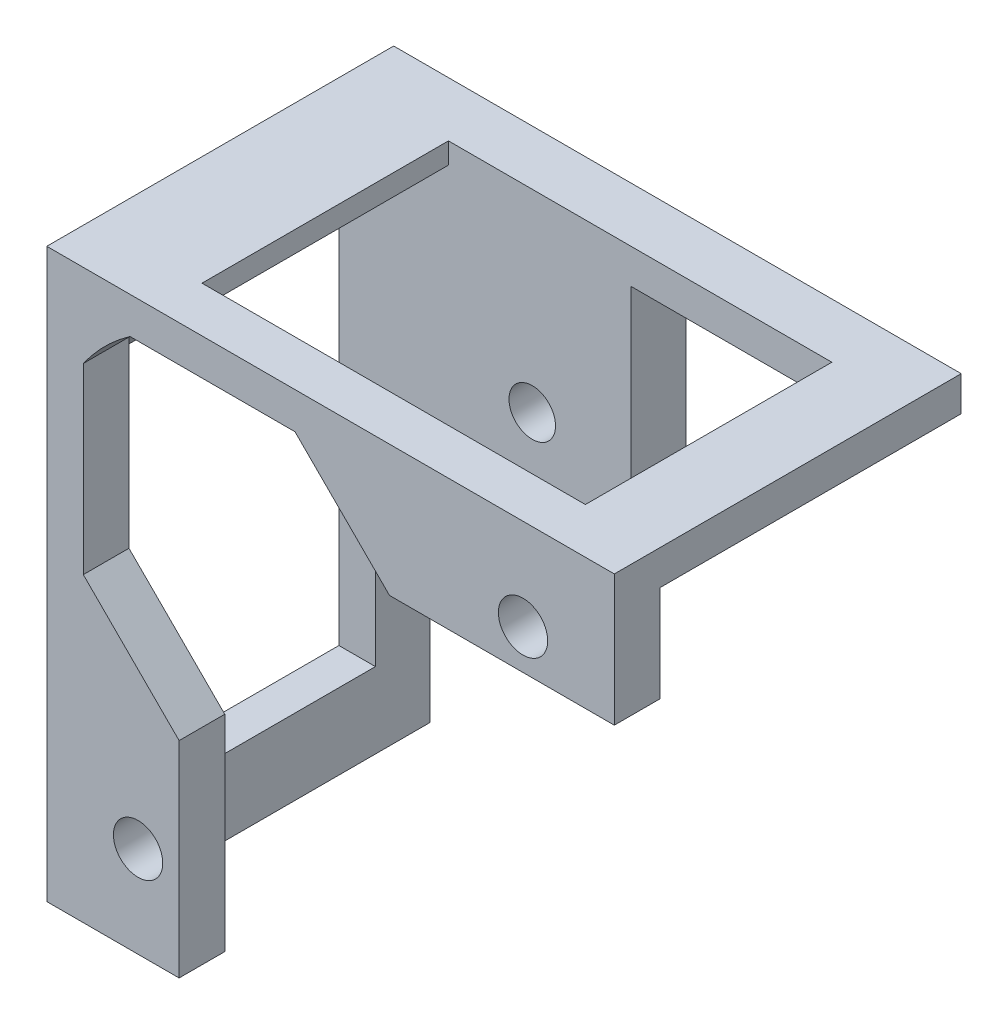
ISO-10303-21;
HEADER;
FILE_DESCRIPTION(('STEP AP214'),'2;1');
FILE_NAME('part.step','',(''),(''),'','','');
FILE_SCHEMA(('AUTOMOTIVE_DESIGN { 1 0 10303 214 1 1 1 1 }'));
ENDSEC;
DATA;
#1=APPLICATION_CONTEXT('core data for automotive mechanical design processes');
#2=APPLICATION_PROTOCOL_DEFINITION('international standard','automotive_design',2000,#1);
#3=PRODUCT_CONTEXT('',#1,'mechanical');
#4=PRODUCT('Part','Part','',(#3));
#5=PRODUCT_RELATED_PRODUCT_CATEGORY('part','',(#4));
#6=PRODUCT_DEFINITION_FORMATION('','',#4);
#7=PRODUCT_DEFINITION_CONTEXT('part definition',#1,'design');
#8=PRODUCT_DEFINITION('design','',#6,#7);
#9=PRODUCT_DEFINITION_SHAPE('','',#8);
#10=(LENGTH_UNIT() NAMED_UNIT(*) SI_UNIT(.MILLI.,.METRE.));
#11=(NAMED_UNIT(*) PLANE_ANGLE_UNIT() SI_UNIT($,.RADIAN.));
#12=(NAMED_UNIT(*) SI_UNIT($,.STERADIAN.) SOLID_ANGLE_UNIT());
#13=UNCERTAINTY_MEASURE_WITH_UNIT(LENGTH_MEASURE(1.E-05),#10,'distance_accuracy_value','');
#14=(GEOMETRIC_REPRESENTATION_CONTEXT(3) GLOBAL_UNCERTAINTY_ASSIGNED_CONTEXT((#13)) GLOBAL_UNIT_ASSIGNED_CONTEXT((#10,
#11,#12)) REPRESENTATION_CONTEXT('',''));
#15=CARTESIAN_POINT('',(0.,0.,0.));
#16=DIRECTION('',(0.,0.,1.));
#17=DIRECTION('',(1.,0.,0.));
#18=AXIS2_PLACEMENT_3D('',#15,#16,#17);
#19=CARTESIAN_POINT('',(-170.,122.805556255077,-421.));
#20=DIRECTION('',(0.,0.,1.));
#21=DIRECTION('',(1.,0.,0.));
#22=AXIS2_PLACEMENT_3D('',#19,#20,#21);
#23=CYLINDRICAL_SURFACE('',#22,2.7);
#24=CARTESIAN_POINT('',(-170.,122.805556255077,-421.));
#25=DIRECTION('',(0.,0.,1.));
#26=DIRECTION('',(1.,0.,0.));
#27=AXIS2_PLACEMENT_3D('',#24,#25,#26);
#28=CIRCLE('',#27,2.7);
#29=CARTESIAN_POINT('',(-172.7,122.805556255077,-421.));
#30=VERTEX_POINT('',#29);
#31=EDGE_CURVE('E471',#30,#30,#28,.T.);
#32=ORIENTED_EDGE('',*,*,#31,.F.);
#33=DIRECTION('',(0.,0.,1.));
#34=VECTOR('',#33,1.);
#35=CARTESIAN_POINT('',(-172.7,122.805556255077,-421.));
#36=LINE('',#35,#34);
#37=CARTESIAN_POINT('',(-172.7,122.805556255077,-416.));
#38=VERTEX_POINT('',#37);
#39=EDGE_CURVE('E11',#30,#38,#36,.T.);
#40=ORIENTED_EDGE('',*,*,#39,.T.);
#41=CARTESIAN_POINT('',(-170.,122.805556255077,-416.));
#42=DIRECTION('',(0.,0.,-1.));
#43=DIRECTION('',(1.,0.,0.));
#44=AXIS2_PLACEMENT_3D('',#41,#42,#43);
#45=CIRCLE('',#44,2.7);
#46=EDGE_CURVE('E350',#38,#38,#45,.T.);
#47=ORIENTED_EDGE('',*,*,#46,.F.);
#48=ORIENTED_EDGE('',*,*,#39,.F.);
#49=EDGE_LOOP('',(#32,#40,#47,#48));
#50=FACE_BOUND('',#49,.T.);
#51=ADVANCED_FACE('F16',(#50),#23,.F.);
#52=CARTESIAN_POINT('',(-127.830959656274,164.974596598802,-421.));
#53=DIRECTION('',(0.,0.,1.));
#54=DIRECTION('',(1.,0.,0.));
#55=AXIS2_PLACEMENT_3D('',#52,#53,#54);
#56=CYLINDRICAL_SURFACE('',#55,2.7);
#57=CARTESIAN_POINT('',(-127.830959656274,164.974596598802,-421.));
#58=DIRECTION('',(0.,0.,1.));
#59=DIRECTION('',(1.,0.,0.));
#60=AXIS2_PLACEMENT_3D('',#57,#58,#59);
#61=CIRCLE('',#60,2.7);
#62=CARTESIAN_POINT('',(-130.530959656274,164.974596598802,-421.));
#63=VERTEX_POINT('',#62);
#64=EDGE_CURVE('E444',#63,#63,#61,.T.);
#65=ORIENTED_EDGE('',*,*,#64,.F.);
#66=DIRECTION('',(0.,0.,1.));
#67=VECTOR('',#66,1.);
#68=CARTESIAN_POINT('',(-130.530959656274,164.974596598802,-421.));
#69=LINE('',#68,#67);
#70=CARTESIAN_POINT('',(-130.530959656274,164.974596598802,-416.));
#71=VERTEX_POINT('',#70);
#72=EDGE_CURVE('E27',#63,#71,#69,.T.);
#73=ORIENTED_EDGE('',*,*,#72,.T.);
#74=CARTESIAN_POINT('',(-127.830959656274,164.974596598802,-416.));
#75=DIRECTION('',(0.,0.,-1.));
#76=DIRECTION('',(1.,0.,0.));
#77=AXIS2_PLACEMENT_3D('',#74,#75,#76);
#78=CIRCLE('',#77,2.7);
#79=EDGE_CURVE('E355',#71,#71,#78,.T.);
#80=ORIENTED_EDGE('',*,*,#79,.F.);
#81=ORIENTED_EDGE('',*,*,#72,.F.);
#82=EDGE_LOOP('',(#65,#73,#80,#81));
#83=FACE_BOUND('',#82,.T.);
#84=ADVANCED_FACE('F689',(#83),#56,.F.);
#85=CARTESIAN_POINT('',(-144.000000730157,148.037299163668,-421.));
#86=DIRECTION('',(0.,0.,-1.));
#87=DIRECTION('',(0.,-1.,0.));
#88=AXIS2_PLACEMENT_3D('',#85,#86,#87);
#89=PLANE('',#88);
#90=ORIENTED_EDGE('',*,*,#31,.T.);
#91=EDGE_LOOP('',(#90));
#92=FACE_BOUND('',#91,.T.);
#93=DIRECTION('',(0.,1.,0.));
#94=VECTOR('',#93,1.);
#95=CARTESIAN_POINT('',(-165.504335240787,140.685936356161,-421.));
#96=LINE('',#95,#94);
#97=CARTESIAN_POINT('',(-165.504335240787,112.805556255077,-421.));
#98=VERTEX_POINT('',#97);
#99=CARTESIAN_POINT('',(-165.504335240787,135.328908789441,-421.));
#100=VERTEX_POINT('',#99);
#101=EDGE_CURVE('E374',#98,#100,#96,.T.);
#102=ORIENTED_EDGE('',*,*,#101,.F.);
#103=DIRECTION('',(-1.,0.,0.));
#104=VECTOR('',#103,1.);
#105=CARTESIAN_POINT('',(-160.,112.805556255077,-421.));
#106=LINE('',#105,#104);
#107=CARTESIAN_POINT('',(-176.,112.805556255077,-421.));
#108=VERTEX_POINT('',#107);
#109=EDGE_CURVE('E469',#98,#108,#106,.T.);
#110=ORIENTED_EDGE('',*,*,#109,.T.);
#111=DIRECTION('',(0.,-1.,0.));
#112=VECTOR('',#111,1.);
#113=CARTESIAN_POINT('',(-176.,130.421427709373,-421.));
#114=LINE('',#113,#112);
#115=CARTESIAN_POINT('',(-176.,121.100001728535,-421.000004917383));
#116=VERTEX_POINT('',#115);
#117=EDGE_CURVE('E296',#116,#108,#114,.T.);
#118=ORIENTED_EDGE('',*,*,#117,.F.);
#119=DIRECTION('',(-1.,0.,0.));
#120=VECTOR('',#119,1.);
#121=CARTESIAN_POINT('',(-180.,121.100001728535,-421.000004917383));
#122=LINE('',#121,#120);
#123=CARTESIAN_POINT('',(-180.,121.100001728535,-421.000004917383));
#124=VERTEX_POINT('',#123);
#125=EDGE_CURVE('E293',#116,#124,#122,.T.);
#126=ORIENTED_EDGE('',*,*,#125,.T.);
#127=DIRECTION('',(0.,1.,0.));
#128=VECTOR('',#127,1.);
#129=CARTESIAN_POINT('',(-180.,121.100001728535,-421.000004917383));
#130=LINE('',#129,#128);
#131=CARTESIAN_POINT('',(-180.,164.100002369285,-421.000004917383));
#132=VERTEX_POINT('',#131);
#133=EDGE_CURVE('E315',#124,#132,#130,.T.);
#134=ORIENTED_EDGE('',*,*,#133,.T.);
#135=DIRECTION('',(1.,0.,0.));
#136=VECTOR('',#135,1.);
#137=CARTESIAN_POINT('',(-180.,164.100002369285,-421.000004917383));
#138=LINE('',#137,#136);
#139=CARTESIAN_POINT('',(-177.109013287322,164.100002369285,-421.000004917383));
#140=VERTEX_POINT('',#139);
#141=EDGE_CURVE('E402',#132,#140,#138,.T.);
#142=ORIENTED_EDGE('',*,*,#141,.T.);
#143=CARTESIAN_POINT('',(-158.82150839458,153.796104993382,-421.));
#144=DIRECTION('',(0.,0.,-1.));
#145=DIRECTION('',(1.,0.,0.));
#146=AXIS2_PLACEMENT_3D('',#143,#144,#145);
#147=CIRCLE('',#146,20.9905487383057);
#148=CARTESIAN_POINT('',(-176.,165.858549293677,-421.));
#149=VERTEX_POINT('',#148);
#150=EDGE_CURVE('E349',#140,#149,#147,.T.);
#151=ORIENTED_EDGE('',*,*,#150,.T.);
#152=DIRECTION('',(0.,1.,0.));
#153=VECTOR('',#152,1.);
#154=CARTESIAN_POINT('',(-176.,112.805556255077,-421.));
#155=LINE('',#154,#153);
#156=CARTESIAN_POINT('',(-176.,145.824573548653,-421.));
#157=VERTEX_POINT('',#156);
#158=EDGE_CURVE('E472',#157,#149,#155,.T.);
#159=ORIENTED_EDGE('',*,*,#158,.F.);
#160=DIRECTION('',(0.707106781186548,-0.707106781186547,0.));
#161=VECTOR('',#160,1.);
#162=CARTESIAN_POINT('',(-165.430681586293,135.255255134946,-421.));
#163=LINE('',#162,#161);
#164=EDGE_CURVE('E375',#157,#100,#163,.T.);
#165=ORIENTED_EDGE('',*,*,#164,.T.);
#166=EDGE_LOOP('',(#102,#110,#118,#126,#134,#142,#151,#159,#165));
#167=FACE_BOUND('',#166,.T.);
#168=ADVANCED_FACE('F555',(#92,#167),#89,.T.);
#169=CARTESIAN_POINT('',(-180.,112.805556255077,-421.));
#170=DIRECTION('',(0.,-1.,0.));
#171=DIRECTION('',(0.,0.,-1.));
#172=AXIS2_PLACEMENT_3D('',#169,#170,#171);
#173=PLANE('',#172);
#174=ORIENTED_EDGE('',*,*,#109,.F.);
#175=DIRECTION('',(0.,0.,1.));
#176=VECTOR('',#175,1.);
#177=CARTESIAN_POINT('',(-165.504335240787,112.805556255077,-418.5));
#178=LINE('',#177,#176);
#179=CARTESIAN_POINT('',(-165.504335240787,112.805556255077,-416.));
#180=VERTEX_POINT('',#179);
#181=EDGE_CURVE('E451',#98,#180,#178,.T.);
#182=ORIENTED_EDGE('',*,*,#181,.T.);
#183=DIRECTION('',(1.,0.,0.));
#184=VECTOR('',#183,1.);
#185=CARTESIAN_POINT('',(-166.004335240787,112.805556255077,-416.));
#186=LINE('',#185,#184);
#187=CARTESIAN_POINT('',(-180.,112.805556255077,-416.));
#188=VERTEX_POINT('',#187);
#189=EDGE_CURVE('E339',#188,#180,#186,.T.);
#190=ORIENTED_EDGE('',*,*,#189,.F.);
#191=DIRECTION('',(0.,0.,1.));
#192=VECTOR('',#191,1.);
#193=CARTESIAN_POINT('',(-180.,112.805556255077,-418.5));
#194=LINE('',#193,#192);
#195=CARTESIAN_POINT('',(-180.,112.805556255077,-454.));
#196=VERTEX_POINT('',#195);
#197=EDGE_CURVE('E290',#196,#188,#194,.T.);
#198=ORIENTED_EDGE('',*,*,#197,.F.);
#199=DIRECTION('',(1.,0.,0.));
#200=VECTOR('',#199,1.);
#201=CARTESIAN_POINT('',(-180.,112.805556255077,-454.));
#202=LINE('',#201,#200);
#203=CARTESIAN_POINT('',(-176.,112.805556255077,-454.));
#204=VERTEX_POINT('',#203);
#205=EDGE_CURVE('E434',#196,#204,#202,.T.);
#206=ORIENTED_EDGE('',*,*,#205,.T.);
#207=DIRECTION('',(0.,0.,-1.));
#208=VECTOR('',#207,1.);
#209=CARTESIAN_POINT('',(-176.,112.805556255077,-421.));
#210=LINE('',#209,#208);
#211=EDGE_CURVE('E304',#108,#204,#210,.T.);
#212=ORIENTED_EDGE('',*,*,#211,.F.);
#213=EDGE_LOOP('',(#174,#182,#190,#198,#206,#212));
#214=FACE_BOUND('',#213,.T.);
#215=ADVANCED_FACE('F678',(#214),#173,.T.);
#216=CARTESIAN_POINT('',(-137.960368081204,170.974596598802,-416.));
#217=DIRECTION('',(0.,-1.,0.));
#218=DIRECTION('',(0.,0.,-1.));
#219=AXIS2_PLACEMENT_3D('',#216,#217,#218);
#220=PLANE('',#219);
#221=DIRECTION('',(0.,0.,1.));
#222=VECTOR('',#221,1.);
#223=CARTESIAN_POINT('',(-152.810368081204,170.974596598802,-416.));
#224=LINE('',#223,#222);
#225=CARTESIAN_POINT('',(-152.810368081204,170.974596598802,-421.));
#226=VERTEX_POINT('',#225);
#227=CARTESIAN_POINT('',(-152.810368081204,170.974596598802,-416.));
#228=VERTEX_POINT('',#227);
#229=EDGE_CURVE('E481',#226,#228,#224,.T.);
#230=ORIENTED_EDGE('',*,*,#229,.T.);
#231=DIRECTION('',(-1.,0.,0.));
#232=VECTOR('',#231,1.);
#233=CARTESIAN_POINT('',(-117.830959656274,170.974596598802,-416.));
#234=LINE('',#233,#232);
#235=CARTESIAN_POINT('',(-170.883952694875,170.974596598802,-416.));
#236=VERTEX_POINT('',#235);
#237=EDGE_CURVE('E504',#228,#236,#234,.T.);
#238=ORIENTED_EDGE('',*,*,#237,.T.);
#239=DIRECTION('',(0.,0.,-1.));
#240=VECTOR('',#239,1.);
#241=CARTESIAN_POINT('',(-170.883952694875,170.974596598802,-454.));
#242=LINE('',#241,#240);
#243=CARTESIAN_POINT('',(-170.883952694875,170.974596598802,-421.));
#244=VERTEX_POINT('',#243);
#245=EDGE_CURVE('E376',#236,#244,#242,.T.);
#246=ORIENTED_EDGE('',*,*,#245,.T.);
#247=DIRECTION('',(1.,0.,0.));
#248=VECTOR('',#247,1.);
#249=CARTESIAN_POINT('',(-140.98018440568,170.974596598802,-421.));
#250=LINE('',#249,#248);
#251=EDGE_CURVE('E410',#244,#226,#250,.T.);
#252=ORIENTED_EDGE('',*,*,#251,.T.);
#253=EDGE_LOOP('',(#230,#238,#246,#252));
#254=FACE_BOUND('',#253,.T.);
#255=ADVANCED_FACE('F680',(#254),#220,.T.);
#256=CARTESIAN_POINT('',(-126.000001728535,174.974596598802,-425.000004902482));
#257=DIRECTION('',(-1.,0.,0.));
#258=DIRECTION('',(0.,0.,1.));
#259=AXIS2_PLACEMENT_3D('',#256,#257,#258);
#260=PLANE('',#259);
#261=DIRECTION('',(0.,1.,0.));
#262=VECTOR('',#261,1.);
#263=CARTESIAN_POINT('',(-126.000001728535,164.385350796092,-448.));
#264=LINE('',#263,#262);
#265=CARTESIAN_POINT('',(-126.000001728535,171.171527858595,-448.000005155802));
#266=VERTEX_POINT('',#265);
#267=CARTESIAN_POINT('',(-126.000001728535,174.974596598802,-448.000005155802));
#268=VERTEX_POINT('',#267);
#269=EDGE_CURVE('E321',#266,#268,#264,.T.);
#270=ORIENTED_EDGE('',*,*,#269,.F.);
#271=DIRECTION('',(0.,0.,1.));
#272=VECTOR('',#271,1.);
#273=CARTESIAN_POINT('',(-126.000001728535,171.171527858595,-431.500002577901));
#274=LINE('',#273,#272);
#275=CARTESIAN_POINT('',(-126.000001728535,171.171527858595,-421.000004902482));
#276=VERTEX_POINT('',#275);
#277=EDGE_CURVE('E20',#266,#276,#274,.T.);
#278=ORIENTED_EDGE('',*,*,#277,.T.);
#279=DIRECTION('',(0.,-1.,0.));
#280=VECTOR('',#279,1.);
#281=CARTESIAN_POINT('',(-126.000001728535,174.974596598802,-421.000004902482));
#282=LINE('',#281,#280);
#283=CARTESIAN_POINT('',(-126.000001728535,174.974596598802,-421.000004902482));
#284=VERTEX_POINT('',#283);
#285=EDGE_CURVE('E399',#284,#276,#282,.T.);
#286=ORIENTED_EDGE('',*,*,#285,.F.);
#287=DIRECTION('',(0.,0.,-1.));
#288=VECTOR('',#287,1.);
#289=CARTESIAN_POINT('',(-126.000001728535,174.974596598802,-429.000002577901));
#290=LINE('',#289,#288);
#291=EDGE_CURVE('E447',#284,#268,#290,.T.);
#292=ORIENTED_EDGE('',*,*,#291,.T.);
#293=EDGE_LOOP('',(#270,#278,#286,#292));
#294=FACE_BOUND('',#293,.T.);
#295=ADVANCED_FACE('F628',(#294),#260,.T.);
#296=CARTESIAN_POINT('',(-176.,112.805556255077,-421.));
#297=DIRECTION('',(-1.,0.,0.));
#298=DIRECTION('',(0.,0.,1.));
#299=AXIS2_PLACEMENT_3D('',#296,#297,#298);
#300=PLANE('',#299);
#301=DIRECTION('',(0.,0.,-1.));
#302=VECTOR('',#301,1.);
#303=CARTESIAN_POINT('',(-176.,145.824573548653,-418.5));
#304=LINE('',#303,#302);
#305=CARTESIAN_POINT('',(-176.,145.824573548653,-416.));
#306=VERTEX_POINT('',#305);
#307=EDGE_CURVE('E370',#306,#157,#304,.T.);
#308=ORIENTED_EDGE('',*,*,#307,.T.);
#309=ORIENTED_EDGE('',*,*,#158,.T.);
#310=DIRECTION('',(0.,0.,1.));
#311=VECTOR('',#310,1.);
#312=CARTESIAN_POINT('',(-176.,165.858549293677,-454.));
#313=LINE('',#312,#311);
#314=CARTESIAN_POINT('',(-176.,165.858549293677,-416.));
#315=VERTEX_POINT('',#314);
#316=EDGE_CURVE('E365',#149,#315,#313,.T.);
#317=ORIENTED_EDGE('',*,*,#316,.T.);
#318=DIRECTION('',(0.,1.,0.));
#319=VECTOR('',#318,1.);
#320=CARTESIAN_POINT('',(-176.,112.805556255077,-416.));
#321=LINE('',#320,#319);
#322=EDGE_CURVE('E389',#306,#315,#321,.T.);
#323=ORIENTED_EDGE('',*,*,#322,.F.);
#324=EDGE_LOOP('',(#308,#309,#317,#323));
#325=FACE_BOUND('',#324,.T.);
#326=ADVANCED_FACE('F18',(#325),#300,.F.);
#327=CARTESIAN_POINT('',(-145.385368081204,163.549596598802,-416.));
#328=DIRECTION('',(0.707106781186548,0.707106781186548,0.));
#329=DIRECTION('',(0.,0.,-1.));
#330=AXIS2_PLACEMENT_3D('',#327,#328,#329);
#331=PLANE('',#330);
#332=DIRECTION('',(0.,0.,-1.));
#333=VECTOR('',#332,1.);
#334=CARTESIAN_POINT('',(-142.459098244505,160.623326762104,-418.5));
#335=LINE('',#334,#333);
#336=CARTESIAN_POINT('',(-142.459098244505,160.623326762104,-416.));
#337=VERTEX_POINT('',#336);
#338=CARTESIAN_POINT('',(-142.459098244505,160.623326762104,-421.));
#339=VERTEX_POINT('',#338);
#340=EDGE_CURVE('E443',#337,#339,#335,.T.);
#341=ORIENTED_EDGE('',*,*,#340,.F.);
#342=DIRECTION('',(0.707106781186548,-0.707106781186548,0.));
#343=VECTOR('',#342,1.);
#344=CARTESIAN_POINT('',(-141.160951884659,159.325180402257,-416.));
#345=LINE('',#344,#343);
#346=EDGE_CURVE('E500',#228,#337,#345,.T.);
#347=ORIENTED_EDGE('',*,*,#346,.F.);
#348=ORIENTED_EDGE('',*,*,#229,.F.);
#349=DIRECTION('',(-0.707106781186548,0.707106781186548,0.));
#350=VECTOR('',#349,1.);
#351=CARTESIAN_POINT('',(-141.160951884659,159.325180402257,-421.));
#352=LINE('',#351,#350);
#353=EDGE_CURVE('E406',#339,#226,#352,.T.);
#354=ORIENTED_EDGE('',*,*,#353,.F.);
#355=EDGE_LOOP('',(#341,#347,#348,#354));
#356=FACE_BOUND('',#355,.T.);
#357=ADVANCED_FACE('F736',(#356),#331,.F.);
#358=CARTESIAN_POINT('',(-180.,174.974596598802,-416.));
#359=DIRECTION('',(0.,1.,0.));
#360=DIRECTION('',(1.,0.,0.));
#361=AXIS2_PLACEMENT_3D('',#358,#359,#360);
#362=PLANE('',#361);
#363=ORIENTED_EDGE('',*,*,#291,.F.);
#364=DIRECTION('',(1.,0.,0.));
#365=VECTOR('',#364,1.);
#366=CARTESIAN_POINT('',(-174.000001177192,174.974596598802,-421.000004902482));
#367=LINE('',#366,#365);
#368=CARTESIAN_POINT('',(-168.000002354383,174.974596598802,-421.000004902482));
#369=VERTEX_POINT('',#368);
#370=EDGE_CURVE('E395',#369,#284,#367,.T.);
#371=ORIENTED_EDGE('',*,*,#370,.F.);
#372=DIRECTION('',(0.,0.,1.));
#373=VECTOR('',#372,1.);
#374=CARTESIAN_POINT('',(-168.000002354383,174.974596598802,-429.000002577901));
#375=LINE('',#374,#373);
#376=CARTESIAN_POINT('',(-168.000002354383,174.974596598802,-448.000005155802));
#377=VERTEX_POINT('',#376);
#378=EDGE_CURVE('E348',#377,#369,#375,.T.);
#379=ORIENTED_EDGE('',*,*,#378,.F.);
#380=DIRECTION('',(1.,0.,0.));
#381=VECTOR('',#380,1.);
#382=CARTESIAN_POINT('',(-153.000000864267,174.974596598802,-448.000005155802));
#383=LINE('',#382,#381);
#384=EDGE_CURVE('E316',#377,#268,#383,.T.);
#385=ORIENTED_EDGE('',*,*,#384,.T.);
#386=EDGE_LOOP('',(#363,#371,#379,#385));
#387=FACE_BOUND('',#386,.T.);
#388=DIRECTION('',(-1.,0.,0.));
#389=VECTOR('',#388,1.);
#390=CARTESIAN_POINT('',(-117.830959656274,174.974596598802,-454.));
#391=LINE('',#390,#389);
#392=CARTESIAN_POINT('',(-117.830959656274,174.974596598802,-454.));
#393=VERTEX_POINT('',#392);
#394=CARTESIAN_POINT('',(-180.,174.974596598802,-454.));
#395=VERTEX_POINT('',#394);
#396=EDGE_CURVE('E334',#393,#395,#391,.T.);
#397=ORIENTED_EDGE('',*,*,#396,.T.);
#398=DIRECTION('',(0.,0.,-1.));
#399=VECTOR('',#398,1.);
#400=CARTESIAN_POINT('',(-180.,174.974596598802,-416.));
#401=LINE('',#400,#399);
#402=CARTESIAN_POINT('',(-180.,174.974596598802,-416.));
#403=VERTEX_POINT('',#402);
#404=EDGE_CURVE('E330',#403,#395,#401,.T.);
#405=ORIENTED_EDGE('',*,*,#404,.F.);
#406=DIRECTION('',(1.,0.,0.));
#407=VECTOR('',#406,1.);
#408=CARTESIAN_POINT('',(-180.,174.974596598802,-416.));
#409=LINE('',#408,#407);
#410=CARTESIAN_POINT('',(-117.830959656274,174.974596598802,-416.));
#411=VERTEX_POINT('',#410);
#412=EDGE_CURVE('E369',#403,#411,#409,.T.);
#413=ORIENTED_EDGE('',*,*,#412,.T.);
#414=DIRECTION('',(0.,0.,-1.));
#415=VECTOR('',#414,1.);
#416=CARTESIAN_POINT('',(-117.830959656274,174.974596598802,-418.5));
#417=LINE('',#416,#415);
#418=EDGE_CURVE('E516',#411,#393,#417,.T.);
#419=ORIENTED_EDGE('',*,*,#418,.T.);
#420=EDGE_LOOP('',(#397,#405,#413,#419));
#421=FACE_BOUND('',#420,.T.);
#422=ADVANCED_FACE('F624',(#387,#421),#362,.T.);
#423=CARTESIAN_POINT('',(-180.,121.100001728535,-443.000005170703));
#424=DIRECTION('',(0.,1.,0.));
#425=DIRECTION('',(1.,0.,0.));
#426=AXIS2_PLACEMENT_3D('',#423,#424,#425);
#427=PLANE('',#426);
#428=DIRECTION('',(1.,0.,0.));
#429=VECTOR('',#428,1.);
#430=CARTESIAN_POINT('',(-169.41075419729,121.100001728535,-448.));
#431=LINE('',#430,#429);
#432=CARTESIAN_POINT('',(-180.,121.100001728535,-448.000005170703));
#433=VERTEX_POINT('',#432);
#434=CARTESIAN_POINT('',(-176.,121.100001728535,-448.000005170703));
#435=VERTEX_POINT('',#434);
#436=EDGE_CURVE('E265',#433,#435,#431,.T.);
#437=ORIENTED_EDGE('',*,*,#436,.F.);
#438=DIRECTION('',(0.,0.,1.));
#439=VECTOR('',#438,1.);
#440=CARTESIAN_POINT('',(-180.,121.100001728535,-421.000002458692));
#441=LINE('',#440,#439);
#442=EDGE_CURVE('E343',#433,#124,#441,.T.);
#443=ORIENTED_EDGE('',*,*,#442,.T.);
#444=ORIENTED_EDGE('',*,*,#125,.F.);
#445=DIRECTION('',(0.,0.,-1.));
#446=VECTOR('',#445,1.);
#447=CARTESIAN_POINT('',(-176.,121.100001728535,-423.500002458692));
#448=LINE('',#447,#446);
#449=EDGE_CURVE('E286',#116,#435,#448,.T.);
#450=ORIENTED_EDGE('',*,*,#449,.T.);
#451=EDGE_LOOP('',(#437,#443,#444,#450));
#452=FACE_BOUND('',#451,.T.);
#453=ADVANCED_FACE('F292',(#452),#427,.T.);
#454=CARTESIAN_POINT('',(-180.,164.100002369285,-426.000004917383));
#455=DIRECTION('',(0.,-1.,0.));
#456=DIRECTION('',(0.,0.,-1.));
#457=AXIS2_PLACEMENT_3D('',#454,#455,#456);
#458=PLANE('',#457);
#459=DIRECTION('',(-1.,0.,0.));
#460=VECTOR('',#459,1.);
#461=CARTESIAN_POINT('',(-169.41075419729,164.100002369285,-448.));
#462=LINE('',#461,#460);
#463=CARTESIAN_POINT('',(-177.109013287322,164.100002369285,-448.000005170703));
#464=VERTEX_POINT('',#463);
#465=CARTESIAN_POINT('',(-180.,164.100002369285,-448.000005170703));
#466=VERTEX_POINT('',#465);
#467=EDGE_CURVE('E280',#464,#466,#462,.T.);
#468=ORIENTED_EDGE('',*,*,#467,.F.);
#469=DIRECTION('',(0.,0.,1.));
#470=VECTOR('',#469,1.);
#471=CARTESIAN_POINT('',(-177.109013287322,164.100002369285,-454.));
#472=LINE('',#471,#470);
#473=EDGE_CURVE('E344',#464,#140,#472,.T.);
#474=ORIENTED_EDGE('',*,*,#473,.T.);
#475=ORIENTED_EDGE('',*,*,#141,.F.);
#476=DIRECTION('',(0.,0.,-1.));
#477=VECTOR('',#476,1.);
#478=CARTESIAN_POINT('',(-180.,164.100002369285,-421.000002458692));
#479=LINE('',#478,#477);
#480=EDGE_CURVE('E311',#132,#466,#479,.T.);
#481=ORIENTED_EDGE('',*,*,#480,.T.);
#482=EDGE_LOOP('',(#468,#474,#475,#481));
#483=FACE_BOUND('',#482,.T.);
#484=ADVANCED_FACE('F562',(#483),#458,.T.);
#485=CARTESIAN_POINT('',(-168.000002354383,174.974596598802,-442.000005155802));
#486=DIRECTION('',(1.,0.,0.));
#487=DIRECTION('',(0.,1.,0.));
#488=AXIS2_PLACEMENT_3D('',#485,#486,#487);
#489=PLANE('',#488);
#490=DIRECTION('',(0.,-1.,0.));
#491=VECTOR('',#490,1.);
#492=CARTESIAN_POINT('',(-168.000002354383,164.385350796092,-448.));
#493=LINE('',#492,#491);
#494=CARTESIAN_POINT('',(-168.000002354383,172.673562051075,-448.000005155802));
#495=VERTEX_POINT('',#494);
#496=EDGE_CURVE('E320',#377,#495,#493,.T.);
#497=ORIENTED_EDGE('',*,*,#496,.F.);
#498=ORIENTED_EDGE('',*,*,#378,.T.);
#499=DIRECTION('',(0.,1.,0.));
#500=VECTOR('',#499,1.);
#501=CARTESIAN_POINT('',(-168.000002354383,174.974596598802,-421.000004902482));
#502=LINE('',#501,#500);
#503=CARTESIAN_POINT('',(-168.000002354383,172.673562051075,-421.000004902482));
#504=VERTEX_POINT('',#503);
#505=EDGE_CURVE('E400',#504,#369,#502,.T.);
#506=ORIENTED_EDGE('',*,*,#505,.F.);
#507=DIRECTION('',(0.,0.,-1.));
#508=VECTOR('',#507,1.);
#509=CARTESIAN_POINT('',(-168.000002354383,172.673562051075,-454.));
#510=LINE('',#509,#508);
#511=EDGE_CURVE('E379',#504,#495,#510,.T.);
#512=ORIENTED_EDGE('',*,*,#511,.T.);
#513=EDGE_LOOP('',(#497,#498,#506,#512));
#514=FACE_BOUND('',#513,.T.);
#515=ADVANCED_FACE('F620',(#514),#489,.T.);
#516=CARTESIAN_POINT('',(-158.82150839458,153.796104993382,-454.));
#517=DIRECTION('',(0.,0.,-1.));
#518=DIRECTION('',(1.,0.,0.));
#519=AXIS2_PLACEMENT_3D('',#516,#517,#518);
#520=CYLINDRICAL_SURFACE('',#519,20.9905487383057);
#521=ORIENTED_EDGE('',*,*,#511,.F.);
#522=CARTESIAN_POINT('',(-158.82150839458,153.796104993382,-421.));
#523=DIRECTION('',(0.,0.,-1.));
#524=DIRECTION('',(1.,0.,0.));
#525=AXIS2_PLACEMENT_3D('',#522,#523,#524);
#526=CIRCLE('',#525,20.9905487383057);
#527=EDGE_CURVE('E604',#244,#504,#526,.T.);
#528=ORIENTED_EDGE('',*,*,#527,.F.);
#529=ORIENTED_EDGE('',*,*,#245,.F.);
#530=CARTESIAN_POINT('',(-158.82150839458,153.796104993382,-416.));
#531=DIRECTION('',(0.,0.,1.));
#532=DIRECTION('',(1.,0.,0.));
#533=AXIS2_PLACEMENT_3D('',#530,#531,#532);
#534=CIRCLE('',#533,20.9905487383057);
#535=EDGE_CURVE('E393',#236,#315,#534,.T.);
#536=ORIENTED_EDGE('',*,*,#535,.T.);
#537=ORIENTED_EDGE('',*,*,#316,.F.);
#538=ORIENTED_EDGE('',*,*,#150,.F.);
#539=ORIENTED_EDGE('',*,*,#473,.F.);
#540=CARTESIAN_POINT('',(-158.82150839458,153.796104993382,-448.));
#541=DIRECTION('',(0.,0.,1.));
#542=DIRECTION('',(1.,0.,0.));
#543=AXIS2_PLACEMENT_3D('',#540,#541,#542);
#544=CIRCLE('',#543,20.9905487383057);
#545=EDGE_CURVE('E535',#495,#464,#544,.T.);
#546=ORIENTED_EDGE('',*,*,#545,.F.);
#547=EDGE_LOOP('',(#521,#528,#529,#536,#537,#538,#539,#546));
#548=FACE_BOUND('',#547,.T.);
#549=ADVANCED_FACE('F565',(#548),#520,.F.);
#550=CARTESIAN_POINT('',(-147.999504675882,141.733660693088,-454.));
#551=DIRECTION('',(1.,0.,0.));
#552=DIRECTION('',(0.,1.,0.));
#553=AXIS2_PLACEMENT_3D('',#550,#551,#552);
#554=PLANE('',#553);
#555=DIRECTION('',(0.,0.,-1.));
#556=VECTOR('',#555,1.);
#557=CARTESIAN_POINT('',(-147.999504675882,148.171660693088,-454.));
#558=LINE('',#557,#556);
#559=CARTESIAN_POINT('',(-147.999504675882,148.171660693088,-448.));
#560=VERTEX_POINT('',#559);
#561=CARTESIAN_POINT('',(-147.999504675882,148.171660693088,-454.));
#562=VERTEX_POINT('',#561);
#563=EDGE_CURVE('E360',#560,#562,#558,.T.);
#564=ORIENTED_EDGE('',*,*,#563,.T.);
#565=DIRECTION('',(0.,1.,0.));
#566=VECTOR('',#565,1.);
#567=CARTESIAN_POINT('',(-147.999504675882,147.764882843235,-454.));
#568=LINE('',#567,#566);
#569=CARTESIAN_POINT('',(-147.999504675882,171.171527858595,-454.));
#570=VERTEX_POINT('',#569);
#571=EDGE_CURVE('E325',#562,#570,#568,.T.);
#572=ORIENTED_EDGE('',*,*,#571,.T.);
#573=DIRECTION('',(0.,0.,1.));
#574=VECTOR('',#573,1.);
#575=CARTESIAN_POINT('',(-147.999504675882,171.171527858595,-421.));
#576=LINE('',#575,#574);
#577=CARTESIAN_POINT('',(-147.999504675882,171.171527858595,-448.));
#578=VERTEX_POINT('',#577);
#579=EDGE_CURVE('E430',#570,#578,#576,.T.);
#580=ORIENTED_EDGE('',*,*,#579,.T.);
#581=DIRECTION('',(0.,-1.,0.));
#582=VECTOR('',#581,1.);
#583=CARTESIAN_POINT('',(-147.999504675882,147.764882843235,-448.));
#584=LINE('',#583,#582);
#585=EDGE_CURVE('E412',#578,#560,#584,.T.);
#586=ORIENTED_EDGE('',*,*,#585,.T.);
#587=EDGE_LOOP('',(#564,#572,#580,#586));
#588=FACE_BOUND('',#587,.T.);
#589=ADVANCED_FACE('F669',(#588),#554,.T.);
#590=CARTESIAN_POINT('',(-176.,143.171660693088,-454.));
#591=DIRECTION('',(0.,-1.,0.));
#592=DIRECTION('',(0.,0.,-1.));
#593=AXIS2_PLACEMENT_3D('',#590,#591,#592);
#594=PLANE('',#593);
#595=DIRECTION('',(0.,0.,1.));
#596=VECTOR('',#595,1.);
#597=CARTESIAN_POINT('',(-152.999504675882,143.171660693088,-454.));
#598=LINE('',#597,#596);
#599=CARTESIAN_POINT('',(-152.999504675882,143.171660693088,-454.));
#600=VERTEX_POINT('',#599);
#601=CARTESIAN_POINT('',(-152.999504675882,143.171660693088,-448.));
#602=VERTEX_POINT('',#601);
#603=EDGE_CURVE('E356',#600,#602,#598,.T.);
#604=ORIENTED_EDGE('',*,*,#603,.T.);
#605=DIRECTION('',(-1.,0.,0.));
#606=VECTOR('',#605,1.);
#607=CARTESIAN_POINT('',(-167.41075419729,143.171660693088,-448.));
#608=LINE('',#607,#606);
#609=CARTESIAN_POINT('',(-176.,143.171660693088,-448.));
#610=VERTEX_POINT('',#609);
#611=EDGE_CURVE('E279',#602,#610,#608,.T.);
#612=ORIENTED_EDGE('',*,*,#611,.T.);
#613=DIRECTION('',(0.,0.,-1.));
#614=VECTOR('',#613,1.);
#615=CARTESIAN_POINT('',(-176.,143.171660693088,-449.));
#616=LINE('',#615,#614);
#617=CARTESIAN_POINT('',(-176.,143.171660693088,-454.));
#618=VERTEX_POINT('',#617);
#619=EDGE_CURVE('E596',#610,#618,#616,.T.);
#620=ORIENTED_EDGE('',*,*,#619,.T.);
#621=DIRECTION('',(1.,0.,0.));
#622=VECTOR('',#621,1.);
#623=CARTESIAN_POINT('',(-167.41075419729,143.171660693088,-454.));
#624=LINE('',#623,#622);
#625=EDGE_CURVE('E388',#618,#600,#624,.T.);
#626=ORIENTED_EDGE('',*,*,#625,.T.);
#627=EDGE_LOOP('',(#604,#612,#620,#626));
#628=FACE_BOUND('',#627,.T.);
#629=ADVANCED_FACE('F709',(#628),#594,.T.);
#630=CARTESIAN_POINT('',(-158.82150839458,153.796104993382,-448.));
#631=DIRECTION('',(0.,0.,1.));
#632=DIRECTION('',(1.,0.,0.));
#633=AXIS2_PLACEMENT_3D('',#630,#631,#632);
#634=PLANE('',#633);
#635=CARTESIAN_POINT('',(-158.82150839458,153.796104993382,-448.));
#636=DIRECTION('',(0.,0.,1.));
#637=DIRECTION('',(-1.,0.,0.));
#638=AXIS2_PLACEMENT_3D('',#635,#636,#637);
#639=CIRCLE('',#638,2.55);
#640=CARTESIAN_POINT('',(-156.27150839458,153.796104993382,-448.));
#641=VERTEX_POINT('',#640);
#642=EDGE_CURVE('E383',#641,#641,#639,.T.);
#643=ORIENTED_EDGE('',*,*,#642,.F.);
#644=EDGE_LOOP('',(#643));
#645=FACE_BOUND('',#644,.T.);
#646=DIRECTION('',(0.707106781186548,0.707106781186548,0.));
#647=VECTOR('',#646,1.);
#648=CARTESIAN_POINT('',(-150.548894530483,145.622270838487,-448.));
#649=LINE('',#648,#647);
#650=EDGE_CURVE('E361',#602,#560,#649,.T.);
#651=ORIENTED_EDGE('',*,*,#650,.T.);
#652=ORIENTED_EDGE('',*,*,#585,.F.);
#653=DIRECTION('',(-1.,0.,0.));
#654=VECTOR('',#653,1.);
#655=CARTESIAN_POINT('',(-152.933006535231,171.171527858595,-448.));
#656=LINE('',#655,#654);
#657=CARTESIAN_POINT('',(-147.044504675882,171.171527858595,-448.));
#658=VERTEX_POINT('',#657);
#659=EDGE_CURVE('E426',#658,#578,#656,.T.);
#660=ORIENTED_EDGE('',*,*,#659,.F.);
#661=DIRECTION('',(-1.,0.,0.));
#662=VECTOR('',#661,1.);
#663=CARTESIAN_POINT('',(-136.522253202208,171.171527858595,-448.000005155802));
#664=LINE('',#663,#662);
#665=EDGE_CURVE('E431',#266,#658,#664,.T.);
#666=ORIENTED_EDGE('',*,*,#665,.F.);
#667=ORIENTED_EDGE('',*,*,#269,.T.);
#668=ORIENTED_EDGE('',*,*,#384,.F.);
#669=ORIENTED_EDGE('',*,*,#496,.T.);
#670=ORIENTED_EDGE('',*,*,#545,.T.);
#671=ORIENTED_EDGE('',*,*,#467,.T.);
#672=DIRECTION('',(0.,1.,0.));
#673=VECTOR('',#672,1.);
#674=CARTESIAN_POINT('',(-180.,142.60000204891,-448.000005170703));
#675=LINE('',#674,#673);
#676=EDGE_CURVE('E273',#433,#466,#675,.T.);
#677=ORIENTED_EDGE('',*,*,#676,.F.);
#678=ORIENTED_EDGE('',*,*,#436,.T.);
#679=DIRECTION('',(0.,-1.,0.));
#680=VECTOR('',#679,1.);
#681=CARTESIAN_POINT('',(-176.,138.452779312181,-448.000005170703));
#682=LINE('',#681,#680);
#683=CARTESIAN_POINT('',(-176.,141.733660693088,-448.));
#684=VERTEX_POINT('',#683);
#685=EDGE_CURVE('E270',#684,#435,#682,.T.);
#686=ORIENTED_EDGE('',*,*,#685,.F.);
#687=DIRECTION('',(0.,-1.,0.));
#688=VECTOR('',#687,1.);
#689=CARTESIAN_POINT('',(-176.,147.764882843235,-448.));
#690=LINE('',#689,#688);
#691=EDGE_CURVE('E288',#610,#684,#690,.T.);
#692=ORIENTED_EDGE('',*,*,#691,.F.);
#693=ORIENTED_EDGE('',*,*,#611,.F.);
#694=EDGE_LOOP('',(#651,#652,#660,#666,#667,#668,#669,#670,#671,#677,#678,#686,#692,#693));
#695=FACE_BOUND('',#694,.T.);
#696=ADVANCED_FACE('F268',(#645,#695),#634,.T.);
#697=CARTESIAN_POINT('',(-150.499504675882,145.671660693088,-454.));
#698=DIRECTION('',(-0.707106781186548,0.707106781186548,0.));
#699=DIRECTION('',(0.,0.,1.));
#700=AXIS2_PLACEMENT_3D('',#697,#698,#699);
#701=PLANE('',#700);
#702=ORIENTED_EDGE('',*,*,#650,.F.);
#703=ORIENTED_EDGE('',*,*,#603,.F.);
#704=DIRECTION('',(-0.707106781186548,-0.707106781186548,0.));
#705=VECTOR('',#704,1.);
#706=CARTESIAN_POINT('',(-150.548894530483,145.622270838487,-454.));
#707=LINE('',#706,#705);
#708=EDGE_CURVE('E384',#562,#600,#707,.T.);
#709=ORIENTED_EDGE('',*,*,#708,.F.);
#710=ORIENTED_EDGE('',*,*,#563,.F.);
#711=EDGE_LOOP('',(#702,#703,#709,#710));
#712=FACE_BOUND('',#711,.T.);
#713=ADVANCED_FACE('F708',(#712),#701,.F.);
#714=CARTESIAN_POINT('',(-117.830959656274,174.974596598802,-421.));
#715=DIRECTION('',(-1.,0.,0.));
#716=DIRECTION('',(0.,0.,1.));
#717=AXIS2_PLACEMENT_3D('',#714,#715,#716);
#718=PLANE('',#717);
#719=DIRECTION('',(0.,0.,1.));
#720=VECTOR('',#719,1.);
#721=CARTESIAN_POINT('',(-117.830959656274,160.623326762104,-418.5));
#722=LINE('',#721,#720);
#723=CARTESIAN_POINT('',(-117.830959656274,160.623326762104,-421.));
#724=VERTEX_POINT('',#723);
#725=CARTESIAN_POINT('',(-117.830959656274,160.623326762104,-416.));
#726=VERTEX_POINT('',#725);
#727=EDGE_CURVE('E440',#724,#726,#722,.T.);
#728=ORIENTED_EDGE('',*,*,#727,.F.);
#729=DIRECTION('',(0.,-1.,0.));
#730=VECTOR('',#729,1.);
#731=CARTESIAN_POINT('',(-117.830959656274,161.505947881235,-421.));
#732=LINE('',#731,#730);
#733=CARTESIAN_POINT('',(-117.830959656274,171.171527858595,-421.));
#734=VERTEX_POINT('',#733);
#735=EDGE_CURVE('E456',#734,#724,#732,.T.);
#736=ORIENTED_EDGE('',*,*,#735,.F.);
#737=DIRECTION('',(0.,0.,-1.));
#738=VECTOR('',#737,1.);
#739=CARTESIAN_POINT('',(-117.830959656274,171.171527858595,-421.));
#740=LINE('',#739,#738);
#741=CARTESIAN_POINT('',(-117.830959656274,171.171527858595,-454.));
#742=VERTEX_POINT('',#741);
#743=EDGE_CURVE('E307',#734,#742,#740,.T.);
#744=ORIENTED_EDGE('',*,*,#743,.T.);
#745=DIRECTION('',(0.,1.,0.));
#746=VECTOR('',#745,1.);
#747=CARTESIAN_POINT('',(-117.830959656274,171.171527858595,-454.));
#748=LINE('',#747,#746);
#749=EDGE_CURVE('E326',#742,#393,#748,.T.);
#750=ORIENTED_EDGE('',*,*,#749,.T.);
#751=ORIENTED_EDGE('',*,*,#418,.F.);
#752=DIRECTION('',(0.,1.,0.));
#753=VECTOR('',#752,1.);
#754=CARTESIAN_POINT('',(-117.830959656274,161.505947881235,-416.));
#755=LINE('',#754,#753);
#756=EDGE_CURVE('E499',#726,#411,#755,.T.);
#757=ORIENTED_EDGE('',*,*,#756,.F.);
#758=EDGE_LOOP('',(#728,#736,#744,#750,#751,#757));
#759=FACE_BOUND('',#758,.T.);
#760=ADVANCED_FACE('F638',(#759),#718,.F.);
#761=CARTESIAN_POINT('',(-117.830959656274,160.623326762104,-416.));
#762=DIRECTION('',(0.,-1.,0.));
#763=DIRECTION('',(0.,0.,-1.));
#764=AXIS2_PLACEMENT_3D('',#761,#762,#763);
#765=PLANE('',#764);
#766=DIRECTION('',(1.,0.,0.));
#767=VECTOR('',#766,1.);
#768=CARTESIAN_POINT('',(-140.98018440568,160.623326762104,-421.));
#769=LINE('',#768,#767);
#770=EDGE_CURVE('E411',#339,#724,#769,.T.);
#771=ORIENTED_EDGE('',*,*,#770,.T.);
#772=ORIENTED_EDGE('',*,*,#727,.T.);
#773=DIRECTION('',(-1.,0.,0.));
#774=VECTOR('',#773,1.);
#775=CARTESIAN_POINT('',(-140.98018440568,160.623326762104,-416.));
#776=LINE('',#775,#774);
#777=EDGE_CURVE('E495',#726,#337,#776,.T.);
#778=ORIENTED_EDGE('',*,*,#777,.T.);
#779=ORIENTED_EDGE('',*,*,#340,.T.);
#780=EDGE_LOOP('',(#771,#772,#778,#779));
#781=FACE_BOUND('',#780,.T.);
#782=ADVANCED_FACE('F641',(#781),#765,.T.);
#783=CARTESIAN_POINT('',(-144.000000730157,148.037299163668,-421.));
#784=DIRECTION('',(0.,0.,-1.));
#785=DIRECTION('',(0.,-1.,0.));
#786=AXIS2_PLACEMENT_3D('',#783,#784,#785);
#787=PLANE('',#786);
#788=ORIENTED_EDGE('',*,*,#64,.T.);
#789=EDGE_LOOP('',(#788));
#790=FACE_BOUND('',#789,.T.);
#791=ORIENTED_EDGE('',*,*,#770,.F.);
#792=ORIENTED_EDGE('',*,*,#353,.T.);
#793=ORIENTED_EDGE('',*,*,#251,.F.);
#794=ORIENTED_EDGE('',*,*,#527,.T.);
#795=ORIENTED_EDGE('',*,*,#505,.T.);
#796=ORIENTED_EDGE('',*,*,#370,.T.);
#797=ORIENTED_EDGE('',*,*,#285,.T.);
#798=DIRECTION('',(-1.,0.,0.));
#799=VECTOR('',#798,1.);
#800=CARTESIAN_POINT('',(-145.52225270302,171.171527858595,-421.));
#801=LINE('',#800,#799);
#802=EDGE_CURVE('E297',#734,#276,#801,.T.);
#803=ORIENTED_EDGE('',*,*,#802,.F.);
#804=ORIENTED_EDGE('',*,*,#735,.T.);
#805=EDGE_LOOP('',(#791,#792,#793,#794,#795,#796,#797,#803,#804));
#806=FACE_BOUND('',#805,.T.);
#807=ADVANCED_FACE('F614',(#790,#806),#787,.T.);
#808=CARTESIAN_POINT('',(-165.504335240787,133.334573548653,-416.));
#809=DIRECTION('',(-1.,0.,0.));
#810=DIRECTION('',(0.,0.,1.));
#811=AXIS2_PLACEMENT_3D('',#808,#809,#810);
#812=PLANE('',#811);
#813=ORIENTED_EDGE('',*,*,#101,.T.);
#814=DIRECTION('',(0.,0.,1.));
#815=VECTOR('',#814,1.);
#816=CARTESIAN_POINT('',(-165.504335240787,135.328908789441,-417.25));
#817=LINE('',#816,#815);
#818=CARTESIAN_POINT('',(-165.504335240787,135.328908789441,-416.));
#819=VERTEX_POINT('',#818);
#820=EDGE_CURVE('E455',#100,#819,#817,.T.);
#821=ORIENTED_EDGE('',*,*,#820,.T.);
#822=DIRECTION('',(0.,1.,0.));
#823=VECTOR('',#822,1.);
#824=CARTESIAN_POINT('',(-165.504335240787,140.685936356161,-416.));
#825=LINE('',#824,#823);
#826=EDGE_CURVE('E494',#180,#819,#825,.T.);
#827=ORIENTED_EDGE('',*,*,#826,.F.);
#828=ORIENTED_EDGE('',*,*,#181,.F.);
#829=EDGE_LOOP('',(#813,#821,#827,#828));
#830=FACE_BOUND('',#829,.T.);
#831=ADVANCED_FACE('F580',(#830),#812,.F.);
#832=CARTESIAN_POINT('',(-169.755,139.579573548653,-418.5));
#833=DIRECTION('',(-0.707106781186547,-0.707106781186548,0.));
#834=DIRECTION('',(-0.707106781186548,0.707106781186547,0.));
#835=AXIS2_PLACEMENT_3D('',#832,#833,#834);
#836=PLANE('',#835);
#837=ORIENTED_EDGE('',*,*,#820,.F.);
#838=ORIENTED_EDGE('',*,*,#164,.F.);
#839=ORIENTED_EDGE('',*,*,#307,.F.);
#840=DIRECTION('',(-0.707106781186548,0.707106781186547,0.));
#841=VECTOR('',#840,1.);
#842=CARTESIAN_POINT('',(-165.430681586293,135.255255134946,-416.));
#843=LINE('',#842,#841);
#844=EDGE_CURVE('E394',#819,#306,#843,.T.);
#845=ORIENTED_EDGE('',*,*,#844,.F.);
#846=EDGE_LOOP('',(#837,#838,#839,#845));
#847=FACE_BOUND('',#846,.T.);
#848=ADVANCED_FACE('F577',(#847),#836,.F.);
#849=CARTESIAN_POINT('',(-180.,121.100001728535,-416.));
#850=DIRECTION('',(-1.,0.,0.));
#851=DIRECTION('',(0.,0.,1.));
#852=AXIS2_PLACEMENT_3D('',#849,#850,#851);
#853=PLANE('',#852);
#854=ORIENTED_EDGE('',*,*,#442,.F.);
#855=ORIENTED_EDGE('',*,*,#676,.T.);
#856=ORIENTED_EDGE('',*,*,#480,.F.);
#857=ORIENTED_EDGE('',*,*,#133,.F.);
#858=EDGE_LOOP('',(#854,#855,#856,#857));
#859=FACE_BOUND('',#858,.T.);
#860=DIRECTION('',(0.,-1.,0.));
#861=VECTOR('',#860,1.);
#862=CARTESIAN_POINT('',(-180.,171.171527858595,-454.));
#863=LINE('',#862,#861);
#864=EDGE_CURVE('E425',#395,#196,#863,.T.);
#865=ORIENTED_EDGE('',*,*,#864,.T.);
#866=ORIENTED_EDGE('',*,*,#197,.T.);
#867=DIRECTION('',(0.,1.,0.));
#868=VECTOR('',#867,1.);
#869=CARTESIAN_POINT('',(-180.,121.100001728535,-416.));
#870=LINE('',#869,#868);
#871=EDGE_CURVE('E335',#188,#403,#870,.T.);
#872=ORIENTED_EDGE('',*,*,#871,.T.);
#873=ORIENTED_EDGE('',*,*,#404,.T.);
#874=EDGE_LOOP('',(#865,#866,#872,#873));
#875=FACE_BOUND('',#874,.T.);
#876=ADVANCED_FACE('F677',(#859,#875),#853,.T.);
#877=CARTESIAN_POINT('',(-176.,112.805556255077,-421.));
#878=DIRECTION('',(-1.,0.,0.));
#879=DIRECTION('',(0.,0.,1.));
#880=AXIS2_PLACEMENT_3D('',#877,#878,#879);
#881=PLANE('',#880);
#882=ORIENTED_EDGE('',*,*,#449,.F.);
#883=ORIENTED_EDGE('',*,*,#117,.T.);
#884=ORIENTED_EDGE('',*,*,#211,.T.);
#885=DIRECTION('',(0.,1.,0.));
#886=VECTOR('',#885,1.);
#887=CARTESIAN_POINT('',(-176.,147.764882843235,-454.));
#888=LINE('',#887,#886);
#889=EDGE_CURVE('E421',#204,#618,#888,.T.);
#890=ORIENTED_EDGE('',*,*,#889,.T.);
#891=ORIENTED_EDGE('',*,*,#619,.F.);
#892=ORIENTED_EDGE('',*,*,#691,.T.);
#893=ORIENTED_EDGE('',*,*,#685,.T.);
#894=EDGE_LOOP('',(#882,#883,#884,#890,#891,#892,#893));
#895=FACE_BOUND('',#894,.T.);
#896=ADVANCED_FACE('F284',(#895),#881,.F.);
#897=CARTESIAN_POINT('',(-147.044504675882,171.171527858595,-421.));
#898=DIRECTION('',(0.,1.,0.));
#899=DIRECTION('',(1.,0.,0.));
#900=AXIS2_PLACEMENT_3D('',#897,#898,#899);
#901=PLANE('',#900);
#902=ORIENTED_EDGE('',*,*,#277,.F.);
#903=ORIENTED_EDGE('',*,*,#665,.T.);
#904=ORIENTED_EDGE('',*,*,#659,.T.);
#905=ORIENTED_EDGE('',*,*,#579,.F.);
#906=DIRECTION('',(1.,0.,0.));
#907=VECTOR('',#906,1.);
#908=CARTESIAN_POINT('',(-176.,171.171527858595,-454.));
#909=LINE('',#908,#907);
#910=EDGE_CURVE('E322',#570,#742,#909,.T.);
#911=ORIENTED_EDGE('',*,*,#910,.T.);
#912=ORIENTED_EDGE('',*,*,#743,.F.);
#913=ORIENTED_EDGE('',*,*,#802,.T.);
#914=EDGE_LOOP('',(#902,#903,#904,#905,#911,#912,#913));
#915=FACE_BOUND('',#914,.T.);
#916=ADVANCED_FACE('F633',(#915),#901,.F.);
#917=CARTESIAN_POINT('',(-158.82150839458,153.796104993382,-448.));
#918=DIRECTION('',(0.,0.,1.));
#919=DIRECTION('',(-1.,0.,0.));
#920=AXIS2_PLACEMENT_3D('',#917,#918,#919);
#921=CYLINDRICAL_SURFACE('',#920,2.55);
#922=CARTESIAN_POINT('',(-158.82150839458,153.796104993382,-454.));
#923=DIRECTION('',(0.,0.,-1.));
#924=DIRECTION('',(-1.,0.,0.));
#925=AXIS2_PLACEMENT_3D('',#922,#923,#924);
#926=CIRCLE('',#925,2.55);
#927=CARTESIAN_POINT('',(-156.27150839458,153.796104993382,-454.));
#928=VERTEX_POINT('',#927);
#929=EDGE_CURVE('E340',#928,#928,#926,.T.);
#930=ORIENTED_EDGE('',*,*,#929,.T.);
#931=DIRECTION('',(0.,0.,1.));
#932=VECTOR('',#931,1.);
#933=CARTESIAN_POINT('',(-156.27150839458,153.796104993382,-448.));
#934=LINE('',#933,#932);
#935=EDGE_CURVE('E354',#928,#641,#934,.T.);
#936=ORIENTED_EDGE('',*,*,#935,.T.);
#937=ORIENTED_EDGE('',*,*,#642,.T.);
#938=ORIENTED_EDGE('',*,*,#935,.F.);
#939=EDGE_LOOP('',(#930,#936,#937,#938));
#940=FACE_BOUND('',#939,.T.);
#941=ADVANCED_FACE('F704',(#940),#921,.F.);
#942=CARTESIAN_POINT('',(-144.000000730157,148.037299163668,-416.));
#943=DIRECTION('',(0.,0.,-1.));
#944=DIRECTION('',(0.,-1.,0.));
#945=AXIS2_PLACEMENT_3D('',#942,#943,#944);
#946=PLANE('',#945);
#947=ORIENTED_EDGE('',*,*,#46,.T.);
#948=EDGE_LOOP('',(#947));
#949=FACE_BOUND('',#948,.T.);
#950=ORIENTED_EDGE('',*,*,#79,.T.);
#951=EDGE_LOOP('',(#950));
#952=FACE_BOUND('',#951,.T.);
#953=ORIENTED_EDGE('',*,*,#871,.F.);
#954=ORIENTED_EDGE('',*,*,#189,.T.);
#955=ORIENTED_EDGE('',*,*,#826,.T.);
#956=ORIENTED_EDGE('',*,*,#844,.T.);
#957=ORIENTED_EDGE('',*,*,#322,.T.);
#958=ORIENTED_EDGE('',*,*,#535,.F.);
#959=ORIENTED_EDGE('',*,*,#237,.F.);
#960=ORIENTED_EDGE('',*,*,#346,.T.);
#961=ORIENTED_EDGE('',*,*,#777,.F.);
#962=ORIENTED_EDGE('',*,*,#756,.T.);
#963=ORIENTED_EDGE('',*,*,#412,.F.);
#964=EDGE_LOOP('',(#953,#954,#955,#956,#957,#958,#959,#960,#961,#962,#963));
#965=FACE_BOUND('',#964,.T.);
#966=ADVANCED_FACE('F573',(#949,#952,#965),#946,.F.);
#967=CARTESIAN_POINT('',(-158.82150839458,153.796104993382,-454.));
#968=DIRECTION('',(0.,0.,-1.));
#969=DIRECTION('',(0.,-1.,0.));
#970=AXIS2_PLACEMENT_3D('',#967,#968,#969);
#971=PLANE('',#970);
#972=ORIENTED_EDGE('',*,*,#929,.F.);
#973=EDGE_LOOP('',(#972));
#974=FACE_BOUND('',#973,.T.);
#975=ORIENTED_EDGE('',*,*,#864,.F.);
#976=ORIENTED_EDGE('',*,*,#396,.F.);
#977=ORIENTED_EDGE('',*,*,#749,.F.);
#978=ORIENTED_EDGE('',*,*,#910,.F.);
#979=ORIENTED_EDGE('',*,*,#571,.F.);
#980=ORIENTED_EDGE('',*,*,#708,.T.);
#981=ORIENTED_EDGE('',*,*,#625,.F.);
#982=ORIENTED_EDGE('',*,*,#889,.F.);
#983=ORIENTED_EDGE('',*,*,#205,.F.);
#984=EDGE_LOOP('',(#975,#976,#977,#978,#979,#980,#981,#982,#983));
#985=FACE_BOUND('',#984,.T.);
#986=ADVANCED_FACE('F674',(#974,#985),#971,.T.);
#987=CLOSED_SHELL('',(#51,#84,#168,#215,#255,#295,#326,#357,#422,#453,#484,#515,#549,#589,#629,
#696,#713,#760,#782,#807,#831,#848,#876,#896,#916,#941,#966,#986));
#988=MANIFOLD_SOLID_BREP('B1',#987);
#989=ADVANCED_BREP_SHAPE_REPRESENTATION('',(#18,#988),#14);
#990=SHAPE_DEFINITION_REPRESENTATION(#9,#989);
ENDSEC;
END-ISO-10303-21;
